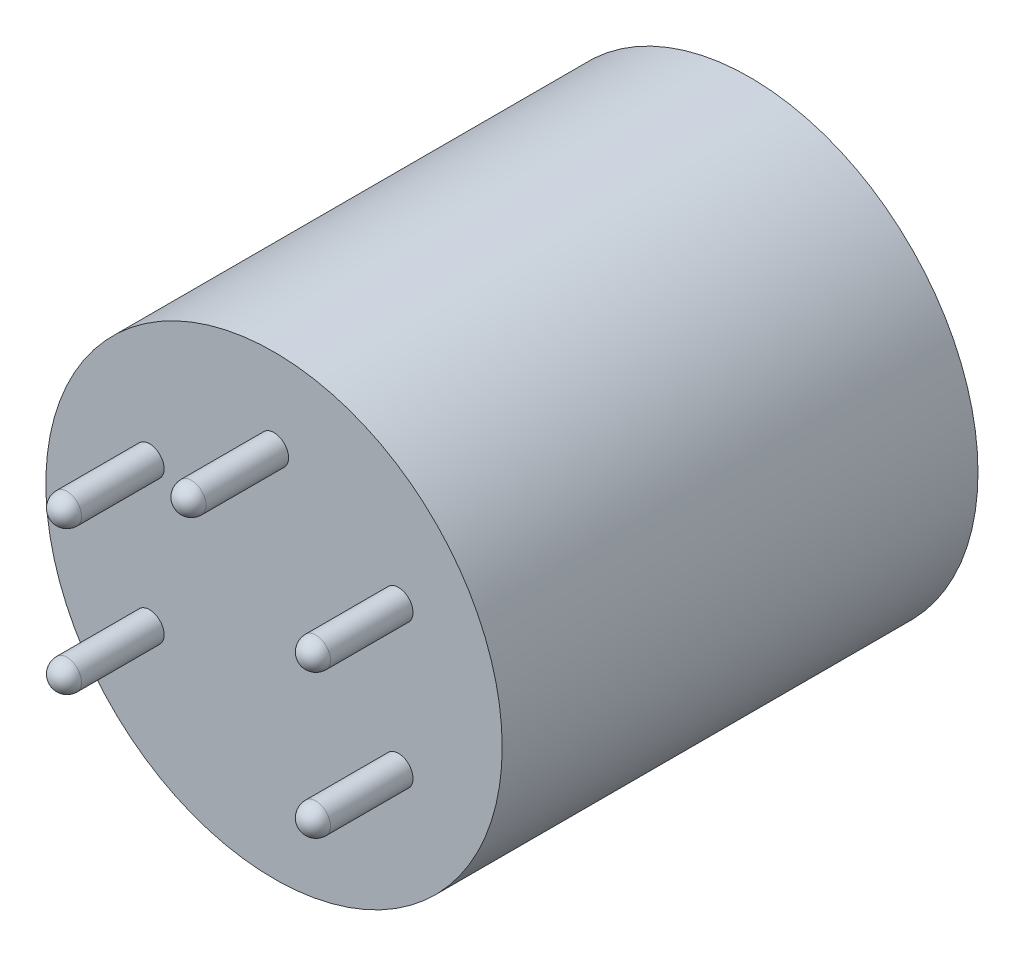
ISO-10303-21;
HEADER;
FILE_DESCRIPTION(('STEP AP214'),'2;1');
FILE_NAME('part.step','',(''),(''),'','','');
FILE_SCHEMA(('AUTOMOTIVE_DESIGN { 1 0 10303 214 1 1 1 1 }'));
ENDSEC;
DATA;
#1=APPLICATION_CONTEXT('core data for automotive mechanical design processes');
#2=APPLICATION_PROTOCOL_DEFINITION('international standard','automotive_design',2000,#1);
#3=PRODUCT_CONTEXT('',#1,'mechanical');
#4=PRODUCT('Part','Part','',(#3));
#5=PRODUCT_RELATED_PRODUCT_CATEGORY('part','',(#4));
#6=PRODUCT_DEFINITION_FORMATION('','',#4);
#7=PRODUCT_DEFINITION_CONTEXT('part definition',#1,'design');
#8=PRODUCT_DEFINITION('design','',#6,#7);
#9=PRODUCT_DEFINITION_SHAPE('','',#8);
#10=(LENGTH_UNIT() NAMED_UNIT(*) SI_UNIT(.MILLI.,.METRE.));
#11=(NAMED_UNIT(*) PLANE_ANGLE_UNIT() SI_UNIT($,.RADIAN.));
#12=(NAMED_UNIT(*) SI_UNIT($,.STERADIAN.) SOLID_ANGLE_UNIT());
#13=UNCERTAINTY_MEASURE_WITH_UNIT(LENGTH_MEASURE(1.E-05),#10,'distance_accuracy_value','');
#14=(GEOMETRIC_REPRESENTATION_CONTEXT(3) GLOBAL_UNCERTAINTY_ASSIGNED_CONTEXT((#13)) GLOBAL_UNIT_ASSIGNED_CONTEXT((#10,
#11,#12)) REPRESENTATION_CONTEXT('',''));
#15=CARTESIAN_POINT('',(0.,0.,0.));
#16=DIRECTION('',(0.,0.,1.));
#17=DIRECTION('',(1.,0.,0.));
#18=AXIS2_PLACEMENT_3D('',#15,#16,#17);
#19=CARTESIAN_POINT('',(0.,0.,0.));
#20=DIRECTION('',(0.,0.,1.));
#21=DIRECTION('',(1.,0.,0.));
#22=AXIS2_PLACEMENT_3D('',#19,#20,#21);
#23=PLANE('',#22);
#24=CARTESIAN_POINT('',(0.,0.,0.));
#25=DIRECTION('',(0.,0.,1.));
#26=DIRECTION('',(1.,0.,0.));
#27=AXIS2_PLACEMENT_3D('',#24,#25,#26);
#28=CIRCLE('',#27,11.75);
#29=CARTESIAN_POINT('',(11.75,0.,0.));
#30=VERTEX_POINT('',#29);
#31=EDGE_CURVE('E76',#30,#30,#28,.T.);
#32=ORIENTED_EDGE('',*,*,#31,.F.);
#33=EDGE_LOOP('',(#32));
#34=FACE_BOUND('',#33,.T.);
#35=CARTESIAN_POINT('',(0.,0.,0.));
#36=DIRECTION('',(0.,0.,1.));
#37=DIRECTION('',(1.,0.,0.));
#38=AXIS2_PLACEMENT_3D('',#35,#36,#37);
#39=CIRCLE('',#38,10.075);
#40=CARTESIAN_POINT('',(-10.075,0.,0.));
#41=VERTEX_POINT('',#40);
#42=EDGE_CURVE('E11',#41,#41,#39,.T.);
#43=ORIENTED_EDGE('',*,*,#42,.T.);
#44=EDGE_LOOP('',(#43));
#45=FACE_BOUND('',#44,.T.);
#46=ADVANCED_FACE('F35',(#34,#45),#23,.F.);
#47=CARTESIAN_POINT('',(0.,0.,24.5));
#48=DIRECTION('',(0.,0.,-1.));
#49=DIRECTION('',(-1.,0.,0.));
#50=AXIS2_PLACEMENT_3D('',#47,#48,#49);
#51=CYLINDRICAL_SURFACE('',#50,11.75);
#52=CARTESIAN_POINT('',(0.,0.,24.5));
#53=DIRECTION('',(0.,0.,1.));
#54=DIRECTION('',(1.,0.,0.));
#55=AXIS2_PLACEMENT_3D('',#52,#53,#54);
#56=CIRCLE('',#55,11.75);
#57=CARTESIAN_POINT('',(11.75,0.,24.5));
#58=VERTEX_POINT('',#57);
#59=EDGE_CURVE('E77',#58,#58,#56,.T.);
#60=ORIENTED_EDGE('',*,*,#59,.F.);
#61=EDGE_LOOP('',(#60));
#62=FACE_BOUND('',#61,.T.);
#63=ORIENTED_EDGE('',*,*,#31,.T.);
#64=EDGE_LOOP('',(#63));
#65=FACE_BOUND('',#64,.T.);
#66=ADVANCED_FACE('F113',(#62,#65),#51,.T.);
#67=CARTESIAN_POINT('',(0.,0.,24.5));
#68=DIRECTION('',(0.,0.,1.));
#69=DIRECTION('',(1.,0.,0.));
#70=AXIS2_PLACEMENT_3D('',#67,#68,#69);
#71=PLANE('',#70);
#72=CARTESIAN_POINT('',(-6.40858798800483,-3.70000000000003,24.5));
#73=DIRECTION('',(0.,0.,1.));
#74=DIRECTION('',(1.,0.,0.));
#75=AXIS2_PLACEMENT_3D('',#72,#73,#74);
#76=CIRCLE('',#75,0.749999999999999);
#77=CARTESIAN_POINT('',(-5.65858798800483,-3.70000000000003,24.5));
#78=VERTEX_POINT('',#77);
#79=EDGE_CURVE('E60',#78,#78,#76,.T.);
#80=ORIENTED_EDGE('',*,*,#79,.F.);
#81=EDGE_LOOP('',(#80));
#82=FACE_BOUND('',#81,.T.);
#83=CARTESIAN_POINT('',(6.40858798800483,-3.70000000000003,24.5));
#84=DIRECTION('',(0.,0.,1.));
#85=DIRECTION('',(1.,0.,0.));
#86=AXIS2_PLACEMENT_3D('',#83,#84,#85);
#87=CIRCLE('',#86,0.75);
#88=CARTESIAN_POINT('',(7.15858798800483,-3.70000000000003,24.5));
#89=VERTEX_POINT('',#88);
#90=EDGE_CURVE('E64',#89,#89,#87,.T.);
#91=ORIENTED_EDGE('',*,*,#90,.F.);
#92=EDGE_LOOP('',(#91));
#93=FACE_BOUND('',#92,.T.);
#94=CARTESIAN_POINT('',(6.40858798800485,3.69999999999999,24.5));
#95=DIRECTION('',(0.,0.,1.));
#96=DIRECTION('',(1.,0.,0.));
#97=AXIS2_PLACEMENT_3D('',#94,#95,#96);
#98=CIRCLE('',#97,0.749999999999999);
#99=CARTESIAN_POINT('',(7.15858798800485,3.69999999999999,24.5));
#100=VERTEX_POINT('',#99);
#101=EDGE_CURVE('E67',#100,#100,#98,.T.);
#102=ORIENTED_EDGE('',*,*,#101,.F.);
#103=EDGE_LOOP('',(#102));
#104=FACE_BOUND('',#103,.T.);
#105=CARTESIAN_POINT('',(0.,7.4,24.5));
#106=DIRECTION('',(0.,0.,1.));
#107=DIRECTION('',(1.,0.,0.));
#108=AXIS2_PLACEMENT_3D('',#105,#106,#107);
#109=CIRCLE('',#108,0.75);
#110=CARTESIAN_POINT('',(0.75,7.4,24.5));
#111=VERTEX_POINT('',#110);
#112=EDGE_CURVE('E70',#111,#111,#109,.T.);
#113=ORIENTED_EDGE('',*,*,#112,.F.);
#114=EDGE_LOOP('',(#113));
#115=FACE_BOUND('',#114,.T.);
#116=CARTESIAN_POINT('',(-6.40858798800486,3.69999999999998,24.5));
#117=DIRECTION('',(0.,0.,1.));
#118=DIRECTION('',(1.,0.,0.));
#119=AXIS2_PLACEMENT_3D('',#116,#117,#118);
#120=CIRCLE('',#119,0.749999999999999);
#121=CARTESIAN_POINT('',(-5.65858798800486,3.69999999999998,24.5));
#122=VERTEX_POINT('',#121);
#123=EDGE_CURVE('E73',#122,#122,#120,.T.);
#124=ORIENTED_EDGE('',*,*,#123,.F.);
#125=EDGE_LOOP('',(#124));
#126=FACE_BOUND('',#125,.T.);
#127=ORIENTED_EDGE('',*,*,#59,.T.);
#128=EDGE_LOOP('',(#127));
#129=FACE_BOUND('',#128,.T.);
#130=ADVANCED_FACE('F119',(#82,#93,#104,#115,#126,#129),#71,.T.);
#131=CARTESIAN_POINT('',(-6.40858798800486,3.69999999999998,29.5));
#132=DIRECTION('',(0.,0.,-1.));
#133=DIRECTION('',(-1.,0.,0.));
#134=AXIS2_PLACEMENT_3D('',#131,#132,#133);
#135=CYLINDRICAL_SURFACE('',#134,0.749999999999999);
#136=CARTESIAN_POINT('',(-6.40858798800486,3.69999999999998,28.75));
#137=DIRECTION('',(0.,0.,-1.));
#138=DIRECTION('',(-1.,0.,0.));
#139=AXIS2_PLACEMENT_3D('',#136,#137,#138);
#140=CIRCLE('',#139,0.749999999999999);
#141=CARTESIAN_POINT('',(-7.15858798800486,3.69999999999998,28.75));
#142=VERTEX_POINT('',#141);
#143=EDGE_CURVE('E94',#142,#142,#140,.T.);
#144=ORIENTED_EDGE('',*,*,#143,.T.);
#145=EDGE_LOOP('',(#144));
#146=FACE_BOUND('',#145,.T.);
#147=ORIENTED_EDGE('',*,*,#123,.T.);
#148=EDGE_LOOP('',(#147));
#149=FACE_BOUND('',#148,.T.);
#150=ADVANCED_FACE('F127',(#146,#149),#135,.T.);
#151=CARTESIAN_POINT('',(0.,7.4,29.5));
#152=DIRECTION('',(0.,0.,-1.));
#153=DIRECTION('',(-1.,0.,0.));
#154=AXIS2_PLACEMENT_3D('',#151,#152,#153);
#155=CYLINDRICAL_SURFACE('',#154,0.75);
#156=CARTESIAN_POINT('',(0.,7.4,28.75));
#157=DIRECTION('',(0.,0.,-1.));
#158=DIRECTION('',(-1.,0.,0.));
#159=AXIS2_PLACEMENT_3D('',#156,#157,#158);
#160=CIRCLE('',#159,0.75);
#161=CARTESIAN_POINT('',(-0.75,7.4,28.75));
#162=VERTEX_POINT('',#161);
#163=EDGE_CURVE('E91',#162,#162,#160,.T.);
#164=ORIENTED_EDGE('',*,*,#163,.T.);
#165=EDGE_LOOP('',(#164));
#166=FACE_BOUND('',#165,.T.);
#167=ORIENTED_EDGE('',*,*,#112,.T.);
#168=EDGE_LOOP('',(#167));
#169=FACE_BOUND('',#168,.T.);
#170=ADVANCED_FACE('F152',(#166,#169),#155,.T.);
#171=CARTESIAN_POINT('',(6.40858798800485,3.69999999999999,29.5));
#172=DIRECTION('',(0.,0.,-1.));
#173=DIRECTION('',(-1.,0.,0.));
#174=AXIS2_PLACEMENT_3D('',#171,#172,#173);
#175=CYLINDRICAL_SURFACE('',#174,0.749999999999999);
#176=CARTESIAN_POINT('',(6.40858798800485,3.69999999999999,28.75));
#177=DIRECTION('',(0.,0.,-1.));
#178=DIRECTION('',(-1.,0.,0.));
#179=AXIS2_PLACEMENT_3D('',#176,#177,#178);
#180=CIRCLE('',#179,0.749999999999999);
#181=CARTESIAN_POINT('',(5.65858798800485,3.69999999999999,28.75));
#182=VERTEX_POINT('',#181);
#183=EDGE_CURVE('E85',#182,#182,#180,.T.);
#184=ORIENTED_EDGE('',*,*,#183,.T.);
#185=EDGE_LOOP('',(#184));
#186=FACE_BOUND('',#185,.T.);
#187=ORIENTED_EDGE('',*,*,#101,.T.);
#188=EDGE_LOOP('',(#187));
#189=FACE_BOUND('',#188,.T.);
#190=ADVANCED_FACE('F155',(#186,#189),#175,.T.);
#191=CARTESIAN_POINT('',(6.40858798800483,-3.70000000000003,29.5));
#192=DIRECTION('',(0.,0.,-1.));
#193=DIRECTION('',(-1.,0.,0.));
#194=AXIS2_PLACEMENT_3D('',#191,#192,#193);
#195=CYLINDRICAL_SURFACE('',#194,0.75);
#196=CARTESIAN_POINT('',(6.40858798800483,-3.70000000000003,28.75));
#197=DIRECTION('',(0.,0.,-1.));
#198=DIRECTION('',(-1.,0.,0.));
#199=AXIS2_PLACEMENT_3D('',#196,#197,#198);
#200=CIRCLE('',#199,0.75);
#201=CARTESIAN_POINT('',(5.65858798800483,-3.70000000000003,28.75));
#202=VERTEX_POINT('',#201);
#203=EDGE_CURVE('E80',#202,#202,#200,.T.);
#204=ORIENTED_EDGE('',*,*,#203,.T.);
#205=EDGE_LOOP('',(#204));
#206=FACE_BOUND('',#205,.T.);
#207=ORIENTED_EDGE('',*,*,#90,.T.);
#208=EDGE_LOOP('',(#207));
#209=FACE_BOUND('',#208,.T.);
#210=ADVANCED_FACE('F171',(#206,#209),#195,.T.);
#211=CARTESIAN_POINT('',(-6.40858798800483,-3.70000000000003,29.5));
#212=DIRECTION('',(0.,0.,-1.));
#213=DIRECTION('',(-1.,0.,0.));
#214=AXIS2_PLACEMENT_3D('',#211,#212,#213);
#215=CYLINDRICAL_SURFACE('',#214,0.749999999999999);
#216=CARTESIAN_POINT('',(-6.40858798800483,-3.70000000000003,28.75));
#217=DIRECTION('',(0.,0.,-1.));
#218=DIRECTION('',(-1.,0.,0.));
#219=AXIS2_PLACEMENT_3D('',#216,#217,#218);
#220=CIRCLE('',#219,0.749999999999999);
#221=CARTESIAN_POINT('',(-7.15858798800483,-3.70000000000003,28.75));
#222=VERTEX_POINT('',#221);
#223=EDGE_CURVE('E88',#222,#222,#220,.T.);
#224=ORIENTED_EDGE('',*,*,#223,.T.);
#225=EDGE_LOOP('',(#224));
#226=FACE_BOUND('',#225,.T.);
#227=ORIENTED_EDGE('',*,*,#79,.T.);
#228=EDGE_LOOP('',(#227));
#229=FACE_BOUND('',#228,.T.);
#230=ADVANCED_FACE('F135',(#226,#229),#215,.T.);
#231=CARTESIAN_POINT('',(6.40858798800483,-3.70000000000003,28.75));
#232=DIRECTION('',(0.,0.,1.));
#233=DIRECTION('',(1.,0.,0.));
#234=AXIS2_PLACEMENT_3D('',#231,#232,#233);
#235=SPHERICAL_SURFACE('',#234,0.75);
#236=ORIENTED_EDGE('',*,*,#203,.F.);
#237=EDGE_LOOP('',(#236));
#238=FACE_BOUND('',#237,.T.);
#239=ADVANCED_FACE('F131',(#238),#235,.T.);
#240=CARTESIAN_POINT('',(6.40858798800485,3.69999999999999,28.75));
#241=DIRECTION('',(0.,0.,1.));
#242=DIRECTION('',(1.,0.,0.));
#243=AXIS2_PLACEMENT_3D('',#240,#241,#242);
#244=SPHERICAL_SURFACE('',#243,0.75);
#245=ORIENTED_EDGE('',*,*,#183,.F.);
#246=EDGE_LOOP('',(#245));
#247=FACE_BOUND('',#246,.T.);
#248=ADVANCED_FACE('F134',(#247),#244,.T.);
#249=CARTESIAN_POINT('',(-6.40858798800483,-3.70000000000003,28.75));
#250=DIRECTION('',(0.,0.,1.));
#251=DIRECTION('',(1.,0.,0.));
#252=AXIS2_PLACEMENT_3D('',#249,#250,#251);
#253=SPHERICAL_SURFACE('',#252,0.75);
#254=ORIENTED_EDGE('',*,*,#223,.F.);
#255=EDGE_LOOP('',(#254));
#256=FACE_BOUND('',#255,.T.);
#257=ADVANCED_FACE('F139',(#256),#253,.T.);
#258=CARTESIAN_POINT('',(0.,7.4,28.75));
#259=DIRECTION('',(0.,0.,1.));
#260=DIRECTION('',(1.,0.,0.));
#261=AXIS2_PLACEMENT_3D('',#258,#259,#260);
#262=SPHERICAL_SURFACE('',#261,0.75);
#263=ORIENTED_EDGE('',*,*,#163,.F.);
#264=EDGE_LOOP('',(#263));
#265=FACE_BOUND('',#264,.T.);
#266=ADVANCED_FACE('F142',(#265),#262,.T.);
#267=CARTESIAN_POINT('',(-6.40858798800486,3.69999999999998,28.75));
#268=DIRECTION('',(0.,0.,1.));
#269=DIRECTION('',(1.,0.,0.));
#270=AXIS2_PLACEMENT_3D('',#267,#268,#269);
#271=SPHERICAL_SURFACE('',#270,0.75);
#272=ORIENTED_EDGE('',*,*,#143,.F.);
#273=EDGE_LOOP('',(#272));
#274=FACE_BOUND('',#273,.T.);
#275=ADVANCED_FACE('F37',(#274),#271,.T.);
#276=CARTESIAN_POINT('',(0.,0.,0.));
#277=DIRECTION('',(0.,0.,-1.));
#278=DIRECTION('',(-1.,0.,0.));
#279=AXIS2_PLACEMENT_3D('',#276,#277,#278);
#280=TOROIDAL_SURFACE('',#279,9.575,0.500000000000001);
#281=ORIENTED_EDGE('',*,*,#42,.F.);
#282=CARTESIAN_POINT('',(-9.575,0.,0.));
#283=DIRECTION('',(0.,1.,0.));
#284=DIRECTION('',(0.,0.,1.));
#285=AXIS2_PLACEMENT_3D('',#282,#283,#284);
#286=CIRCLE('',#285,0.500000000000001);
#287=CARTESIAN_POINT('',(-9.075,0.,0.));
#288=VERTEX_POINT('',#287);
#289=EDGE_CURVE('E50',#288,#41,#286,.T.);
#290=ORIENTED_EDGE('',*,*,#289,.F.);
#291=CARTESIAN_POINT('',(0.,0.,0.));
#292=DIRECTION('',(0.,0.,-1.));
#293=DIRECTION('',(-1.,0.,0.));
#294=AXIS2_PLACEMENT_3D('',#291,#292,#293);
#295=CIRCLE('',#294,9.075);
#296=EDGE_CURVE('E43',#288,#288,#295,.T.);
#297=ORIENTED_EDGE('',*,*,#296,.F.);
#298=ORIENTED_EDGE('',*,*,#289,.T.);
#299=EDGE_LOOP('',(#281,#290,#297,#298));
#300=FACE_BOUND('',#299,.T.);
#301=ADVANCED_FACE('F51',(#300),#280,.T.);
#302=CARTESIAN_POINT('',(0.,0.,1.5));
#303=DIRECTION('',(0.,0.,-1.));
#304=DIRECTION('',(-1.,0.,0.));
#305=AXIS2_PLACEMENT_3D('',#302,#303,#304);
#306=PLANE('',#305);
#307=CARTESIAN_POINT('',(0.,0.,1.5));
#308=DIRECTION('',(0.,0.,-1.));
#309=DIRECTION('',(-1.,0.,0.));
#310=AXIS2_PLACEMENT_3D('',#307,#308,#309);
#311=CIRCLE('',#310,7.4);
#312=CARTESIAN_POINT('',(-7.4,0.,1.5));
#313=VERTEX_POINT('',#312);
#314=EDGE_CURVE('E56',#313,#313,#311,.T.);
#315=ORIENTED_EDGE('',*,*,#314,.T.);
#316=EDGE_LOOP('',(#315));
#317=FACE_BOUND('',#316,.T.);
#318=ADVANCED_FACE('F106',(#317),#306,.T.);
#319=CARTESIAN_POINT('',(0.,0.,1.5));
#320=DIRECTION('',(0.,0.,-1.));
#321=DIRECTION('',(-1.,0.,0.));
#322=AXIS2_PLACEMENT_3D('',#319,#320,#321);
#323=CYLINDRICAL_SURFACE('',#322,7.4);
#324=ORIENTED_EDGE('',*,*,#314,.F.);
#325=EDGE_LOOP('',(#324));
#326=FACE_BOUND('',#325,.T.);
#327=CARTESIAN_POINT('',(0.,0.,0.));
#328=DIRECTION('',(0.,0.,-1.));
#329=DIRECTION('',(-1.,0.,0.));
#330=AXIS2_PLACEMENT_3D('',#327,#328,#329);
#331=CIRCLE('',#330,7.4);
#332=CARTESIAN_POINT('',(-7.4,0.,0.));
#333=VERTEX_POINT('',#332);
#334=EDGE_CURVE('E53',#333,#333,#331,.T.);
#335=ORIENTED_EDGE('',*,*,#334,.T.);
#336=EDGE_LOOP('',(#335));
#337=FACE_BOUND('',#336,.T.);
#338=ADVANCED_FACE('F99',(#326,#337),#323,.F.);
#339=ORIENTED_EDGE('',*,*,#334,.F.);
#340=EDGE_LOOP('',(#339));
#341=FACE_BOUND('',#340,.T.);
#342=ORIENTED_EDGE('',*,*,#296,.T.);
#343=EDGE_LOOP('',(#342));
#344=FACE_BOUND('',#343,.T.);
#345=ADVANCED_FACE('F97',(#341,#344),#23,.F.);
#346=CLOSED_SHELL('',(#46,#66,#130,#150,#170,#190,#210,#230,#239,#248,#257,#266,#275,#301,#318,
#338,#345));
#347=MANIFOLD_SOLID_BREP('B2',#346);
#348=ADVANCED_BREP_SHAPE_REPRESENTATION('',(#18,#347),#14);
#349=SHAPE_DEFINITION_REPRESENTATION(#9,#348);
ENDSEC;
END-ISO-10303-21;
